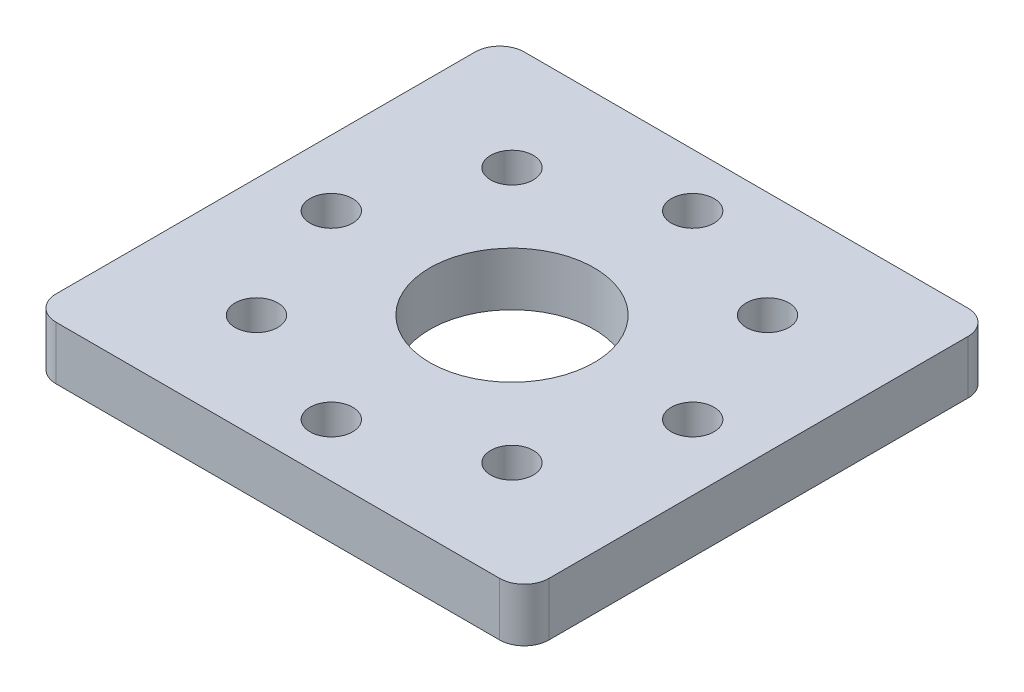
ISO-10303-21;
HEADER;
FILE_DESCRIPTION(('STEP AP214'),'2;1');
FILE_NAME('part.step','',(''),(''),'','','');
FILE_SCHEMA(('AUTOMOTIVE_DESIGN { 1 0 10303 214 1 1 1 1 }'));
ENDSEC;
DATA;
#1=APPLICATION_CONTEXT('core data for automotive mechanical design processes');
#2=APPLICATION_PROTOCOL_DEFINITION('international standard','automotive_design',2000,#1);
#3=PRODUCT_CONTEXT('',#1,'mechanical');
#4=PRODUCT('Part','Part','',(#3));
#5=PRODUCT_RELATED_PRODUCT_CATEGORY('part','',(#4));
#6=PRODUCT_DEFINITION_FORMATION('','',#4);
#7=PRODUCT_DEFINITION_CONTEXT('part definition',#1,'design');
#8=PRODUCT_DEFINITION('design','',#6,#7);
#9=PRODUCT_DEFINITION_SHAPE('','',#8);
#10=(LENGTH_UNIT() NAMED_UNIT(*) SI_UNIT(.MILLI.,.METRE.));
#11=(NAMED_UNIT(*) PLANE_ANGLE_UNIT() SI_UNIT($,.RADIAN.));
#12=(NAMED_UNIT(*) SI_UNIT($,.STERADIAN.) SOLID_ANGLE_UNIT());
#13=UNCERTAINTY_MEASURE_WITH_UNIT(LENGTH_MEASURE(1.E-05),#10,'distance_accuracy_value','');
#14=(GEOMETRIC_REPRESENTATION_CONTEXT(3) GLOBAL_UNCERTAINTY_ASSIGNED_CONTEXT((#13)) GLOBAL_UNIT_ASSIGNED_CONTEXT((#10,
#11,#12)) REPRESENTATION_CONTEXT('',''));
#15=CARTESIAN_POINT('',(0.,0.,0.));
#16=DIRECTION('',(0.,0.,1.));
#17=DIRECTION('',(1.,0.,0.));
#18=AXIS2_PLACEMENT_3D('',#15,#16,#17);
#19=CARTESIAN_POINT('',(-15.,0.1,-14.25));
#20=DIRECTION('',(1.,0.,0.));
#21=DIRECTION('',(0.,0.,-1.));
#22=AXIS2_PLACEMENT_3D('',#19,#20,#21);
#23=PLANE('',#22);
#24=DIRECTION('',(0.,0.,1.));
#25=VECTOR('',#24,1.);
#26=CARTESIAN_POINT('',(-15.,-3.15,-14.25));
#27=LINE('',#26,#25);
#28=CARTESIAN_POINT('',(-15.,-3.15,-12.75));
#29=VERTEX_POINT('',#28);
#30=CARTESIAN_POINT('',(-15.,-3.15,12.75));
#31=VERTEX_POINT('',#30);
#32=EDGE_CURVE('E136',#29,#31,#27,.T.);
#33=ORIENTED_EDGE('',*,*,#32,.T.);
#34=DIRECTION('',(0.,-1.,0.));
#35=VECTOR('',#34,1.);
#36=CARTESIAN_POINT('',(-15.,0.1,12.75));
#37=LINE('',#36,#35);
#38=CARTESIAN_POINT('',(-15.,0.1,12.75));
#39=VERTEX_POINT('',#38);
#40=EDGE_CURVE('E166',#31,#39,#37,.F.);
#41=ORIENTED_EDGE('',*,*,#40,.T.);
#42=DIRECTION('',(0.,0.,1.));
#43=VECTOR('',#42,1.);
#44=CARTESIAN_POINT('',(-15.,0.1,-14.25));
#45=LINE('',#44,#43);
#46=CARTESIAN_POINT('',(-15.,0.1,-12.75));
#47=VERTEX_POINT('',#46);
#48=EDGE_CURVE('E134',#47,#39,#45,.T.);
#49=ORIENTED_EDGE('',*,*,#48,.F.);
#50=DIRECTION('',(0.,-1.,0.));
#51=VECTOR('',#50,1.);
#52=CARTESIAN_POINT('',(-15.,0.1,-12.75));
#53=LINE('',#52,#51);
#54=EDGE_CURVE('E163',#47,#29,#53,.T.);
#55=ORIENTED_EDGE('',*,*,#54,.T.);
#56=EDGE_LOOP('',(#33,#41,#49,#55));
#57=FACE_BOUND('',#56,.T.);
#58=ADVANCED_FACE('F41',(#57),#23,.F.);
#59=CARTESIAN_POINT('',(-15.,0.1,14.25));
#60=DIRECTION('',(0.,0.,-1.));
#61=DIRECTION('',(-1.,0.,0.));
#62=AXIS2_PLACEMENT_3D('',#59,#60,#61);
#63=PLANE('',#62);
#64=DIRECTION('',(1.,0.,0.));
#65=VECTOR('',#64,1.);
#66=CARTESIAN_POINT('',(-15.,-3.15,14.25));
#67=LINE('',#66,#65);
#68=CARTESIAN_POINT('',(-13.5,-3.15,14.25));
#69=VERTEX_POINT('',#68);
#70=CARTESIAN_POINT('',(13.5,-3.15,14.25));
#71=VERTEX_POINT('',#70);
#72=EDGE_CURVE('E132',#69,#71,#67,.T.);
#73=ORIENTED_EDGE('',*,*,#72,.T.);
#74=DIRECTION('',(0.,-1.,0.));
#75=VECTOR('',#74,1.);
#76=CARTESIAN_POINT('',(13.5,0.1,14.25));
#77=LINE('',#76,#75);
#78=CARTESIAN_POINT('',(13.5,0.1,14.25));
#79=VERTEX_POINT('',#78);
#80=EDGE_CURVE('E111',#71,#79,#77,.F.);
#81=ORIENTED_EDGE('',*,*,#80,.T.);
#82=DIRECTION('',(1.,0.,0.));
#83=VECTOR('',#82,1.);
#84=CARTESIAN_POINT('',(-15.,0.1,14.25));
#85=LINE('',#84,#83);
#86=CARTESIAN_POINT('',(-13.5,0.1,14.25));
#87=VERTEX_POINT('',#86);
#88=EDGE_CURVE('E142',#87,#79,#85,.T.);
#89=ORIENTED_EDGE('',*,*,#88,.F.);
#90=DIRECTION('',(0.,-1.,0.));
#91=VECTOR('',#90,1.);
#92=CARTESIAN_POINT('',(-13.5,0.1,14.25));
#93=LINE('',#92,#91);
#94=EDGE_CURVE('E116',#87,#69,#93,.T.);
#95=ORIENTED_EDGE('',*,*,#94,.T.);
#96=EDGE_LOOP('',(#73,#81,#89,#95));
#97=FACE_BOUND('',#96,.T.);
#98=ADVANCED_FACE('F187',(#97),#63,.F.);
#99=CARTESIAN_POINT('',(15.,0.1,-14.25));
#100=DIRECTION('',(-1.,0.,0.));
#101=DIRECTION('',(0.,0.,1.));
#102=AXIS2_PLACEMENT_3D('',#99,#100,#101);
#103=PLANE('',#102);
#104=DIRECTION('',(0.,0.,-1.));
#105=VECTOR('',#104,1.);
#106=CARTESIAN_POINT('',(15.,0.1,-14.25));
#107=LINE('',#106,#105);
#108=CARTESIAN_POINT('',(15.,0.1,12.75));
#109=VERTEX_POINT('',#108);
#110=CARTESIAN_POINT('',(15.,0.1,-12.75));
#111=VERTEX_POINT('',#110);
#112=EDGE_CURVE('E125',#109,#111,#107,.T.);
#113=ORIENTED_EDGE('',*,*,#112,.F.);
#114=DIRECTION('',(0.,-1.,0.));
#115=VECTOR('',#114,1.);
#116=CARTESIAN_POINT('',(15.,0.1,12.75));
#117=LINE('',#116,#115);
#118=CARTESIAN_POINT('',(15.,-3.15,12.75));
#119=VERTEX_POINT('',#118);
#120=EDGE_CURVE('E110',#109,#119,#117,.T.);
#121=ORIENTED_EDGE('',*,*,#120,.T.);
#122=DIRECTION('',(0.,0.,-1.));
#123=VECTOR('',#122,1.);
#124=CARTESIAN_POINT('',(15.,-3.15,-14.25));
#125=LINE('',#124,#123);
#126=CARTESIAN_POINT('',(15.,-3.15,-12.75));
#127=VERTEX_POINT('',#126);
#128=EDGE_CURVE('E123',#119,#127,#125,.T.);
#129=ORIENTED_EDGE('',*,*,#128,.T.);
#130=DIRECTION('',(0.,-1.,0.));
#131=VECTOR('',#130,1.);
#132=CARTESIAN_POINT('',(15.,0.1,-12.75));
#133=LINE('',#132,#131);
#134=EDGE_CURVE('E127',#127,#111,#133,.F.);
#135=ORIENTED_EDGE('',*,*,#134,.T.);
#136=EDGE_LOOP('',(#113,#121,#129,#135));
#137=FACE_BOUND('',#136,.T.);
#138=ADVANCED_FACE('F122',(#137),#103,.F.);
#139=CARTESIAN_POINT('',(-15.,0.1,-14.25));
#140=DIRECTION('',(0.,0.,1.));
#141=DIRECTION('',(1.,0.,0.));
#142=AXIS2_PLACEMENT_3D('',#139,#140,#141);
#143=PLANE('',#142);
#144=DIRECTION('',(-1.,0.,0.));
#145=VECTOR('',#144,1.);
#146=CARTESIAN_POINT('',(-15.,-3.15,-14.25));
#147=LINE('',#146,#145);
#148=CARTESIAN_POINT('',(13.5,-3.15,-14.25));
#149=VERTEX_POINT('',#148);
#150=CARTESIAN_POINT('',(-13.5,-3.15,-14.25));
#151=VERTEX_POINT('',#150);
#152=EDGE_CURVE('E131',#149,#151,#147,.T.);
#153=ORIENTED_EDGE('',*,*,#152,.T.);
#154=DIRECTION('',(0.,-1.,0.));
#155=VECTOR('',#154,1.);
#156=CARTESIAN_POINT('',(-13.5,0.1,-14.25));
#157=LINE('',#156,#155);
#158=CARTESIAN_POINT('',(-13.5,0.1,-14.25));
#159=VERTEX_POINT('',#158);
#160=EDGE_CURVE('E11',#151,#159,#157,.F.);
#161=ORIENTED_EDGE('',*,*,#160,.T.);
#162=DIRECTION('',(-1.,0.,0.));
#163=VECTOR('',#162,1.);
#164=CARTESIAN_POINT('',(-15.,0.1,-14.25));
#165=LINE('',#164,#163);
#166=CARTESIAN_POINT('',(13.5,0.1,-14.25));
#167=VERTEX_POINT('',#166);
#168=EDGE_CURVE('E146',#167,#159,#165,.T.);
#169=ORIENTED_EDGE('',*,*,#168,.F.);
#170=DIRECTION('',(0.,-1.,0.));
#171=VECTOR('',#170,1.);
#172=CARTESIAN_POINT('',(13.5,0.1,-14.25));
#173=LINE('',#172,#171);
#174=EDGE_CURVE('E49',#167,#149,#173,.T.);
#175=ORIENTED_EDGE('',*,*,#174,.T.);
#176=EDGE_LOOP('',(#153,#161,#169,#175));
#177=FACE_BOUND('',#176,.T.);
#178=ADVANCED_FACE('F169',(#177),#143,.F.);
#179=CARTESIAN_POINT('',(0.,0.1,0.));
#180=DIRECTION('',(0.,1.,0.));
#181=DIRECTION('',(0.,0.,1.));
#182=AXIS2_PLACEMENT_3D('',#179,#180,#181);
#183=PLANE('',#182);
#184=CARTESIAN_POINT('',(0.,0.1,-11.));
#185=DIRECTION('',(0.,1.,0.));
#186=DIRECTION('',(0.,0.,1.));
#187=AXIS2_PLACEMENT_3D('',#184,#185,#186);
#188=CIRCLE('',#187,1.3);
#189=CARTESIAN_POINT('',(0.,0.1,-9.7));
#190=VERTEX_POINT('',#189);
#191=EDGE_CURVE('E446',#190,#190,#188,.T.);
#192=ORIENTED_EDGE('',*,*,#191,.F.);
#193=EDGE_LOOP('',(#192));
#194=FACE_BOUND('',#193,.T.);
#195=CARTESIAN_POINT('',(7.77817459305216,0.1,-7.77817459305235));
#196=DIRECTION('',(0.,1.,0.));
#197=DIRECTION('',(0.,0.,1.));
#198=AXIS2_PLACEMENT_3D('',#195,#196,#197);
#199=CIRCLE('',#198,1.30000000000005);
#200=CARTESIAN_POINT('',(7.77817459305216,0.1,-6.4781745930523));
#201=VERTEX_POINT('',#200);
#202=EDGE_CURVE('E452',#201,#201,#199,.T.);
#203=ORIENTED_EDGE('',*,*,#202,.F.);
#204=EDGE_LOOP('',(#203));
#205=FACE_BOUND('',#204,.T.);
#206=CARTESIAN_POINT('',(11.0000000000005,0.1,-4.66937538383073E-13));
#207=DIRECTION('',(0.,1.,0.));
#208=DIRECTION('',(0.,0.,1.));
#209=AXIS2_PLACEMENT_3D('',#206,#207,#208);
#210=CIRCLE('',#209,1.30000000000035);
#211=CARTESIAN_POINT('',(11.0000000000005,0.1,1.29999999999988));
#212=VERTEX_POINT('',#211);
#213=EDGE_CURVE('E463',#212,#212,#210,.T.);
#214=ORIENTED_EDGE('',*,*,#213,.F.);
#215=EDGE_LOOP('',(#214));
#216=FACE_BOUND('',#215,.T.);
#217=CARTESIAN_POINT('',(7.77817459305282,0.1,7.77817459305169));
#218=DIRECTION('',(0.,1.,0.));
#219=DIRECTION('',(0.,0.,1.));
#220=AXIS2_PLACEMENT_3D('',#217,#218,#219);
#221=CIRCLE('',#220,1.30000000000072);
#222=CARTESIAN_POINT('',(7.77817459305282,0.1,9.07817459305241));
#223=VERTEX_POINT('',#222);
#224=EDGE_CURVE('E469',#223,#223,#221,.T.);
#225=ORIENTED_EDGE('',*,*,#224,.F.);
#226=EDGE_LOOP('',(#225));
#227=FACE_BOUND('',#226,.T.);
#228=CARTESIAN_POINT('',(9.33875076766146E-13,0.1,11.));
#229=DIRECTION('',(0.,1.,0.));
#230=DIRECTION('',(0.,0.,1.));
#231=AXIS2_PLACEMENT_3D('',#228,#229,#230);
#232=CIRCLE('',#231,1.30000000000097);
#233=CARTESIAN_POINT('',(9.33875076766146E-13,0.1,12.300000000001));
#234=VERTEX_POINT('',#233);
#235=EDGE_CURVE('E475',#234,#234,#232,.T.);
#236=ORIENTED_EDGE('',*,*,#235,.F.);
#237=EDGE_LOOP('',(#236));
#238=FACE_BOUND('',#237,.T.);
#239=CARTESIAN_POINT('',(-7.77817459305122,0.1,7.77817459305235));
#240=DIRECTION('',(0.,1.,0.));
#241=DIRECTION('',(0.,0.,1.));
#242=AXIS2_PLACEMENT_3D('',#239,#240,#241);
#243=CIRCLE('',#242,1.30000000000095);
#244=CARTESIAN_POINT('',(-7.77817459305122,0.1,9.0781745930533));
#245=VERTEX_POINT('',#244);
#246=EDGE_CURVE('E490',#245,#245,#243,.T.);
#247=ORIENTED_EDGE('',*,*,#246,.F.);
#248=EDGE_LOOP('',(#247));
#249=FACE_BOUND('',#248,.T.);
#250=CARTESIAN_POINT('',(-10.9999999999995,0.1,4.68284649862135E-13));
#251=DIRECTION('',(0.,1.,0.));
#252=DIRECTION('',(0.,0.,1.));
#253=AXIS2_PLACEMENT_3D('',#250,#251,#252);
#254=CIRCLE('',#253,1.30000000000069);
#255=CARTESIAN_POINT('',(-10.9999999999995,0.1,1.30000000000116));
#256=VERTEX_POINT('',#255);
#257=EDGE_CURVE('E498',#256,#256,#254,.T.);
#258=ORIENTED_EDGE('',*,*,#257,.F.);
#259=EDGE_LOOP('',(#258));
#260=FACE_BOUND('',#259,.T.);
#261=CARTESIAN_POINT('',(-7.77817459305189,0.1,-7.77817459305169));
#262=DIRECTION('',(0.,1.,0.));
#263=DIRECTION('',(0.,0.,1.));
#264=AXIS2_PLACEMENT_3D('',#261,#262,#263);
#265=CIRCLE('',#264,1.30000000000036);
#266=CARTESIAN_POINT('',(-7.77817459305189,0.1,-6.47817459305133));
#267=VERTEX_POINT('',#266);
#268=EDGE_CURVE('E503',#267,#267,#265,.T.);
#269=ORIENTED_EDGE('',*,*,#268,.F.);
#270=EDGE_LOOP('',(#269));
#271=FACE_BOUND('',#270,.T.);
#272=CARTESIAN_POINT('',(0.,0.1,0.));
#273=DIRECTION('',(0.,1.,0.));
#274=DIRECTION('',(0.,0.,1.));
#275=AXIS2_PLACEMENT_3D('',#272,#273,#274);
#276=CIRCLE('',#275,5.);
#277=CARTESIAN_POINT('',(0.,0.1,5.));
#278=VERTEX_POINT('',#277);
#279=EDGE_CURVE('E447',#278,#278,#276,.T.);
#280=ORIENTED_EDGE('',*,*,#279,.F.);
#281=EDGE_LOOP('',(#280));
#282=FACE_BOUND('',#281,.T.);
#283=ORIENTED_EDGE('',*,*,#88,.T.);
#284=CARTESIAN_POINT('',(13.5,0.1,12.75));
#285=DIRECTION('',(0.,1.,0.));
#286=DIRECTION('',(0.,0.,1.));
#287=AXIS2_PLACEMENT_3D('',#284,#285,#286);
#288=CIRCLE('',#287,1.5);
#289=EDGE_CURVE('E161',#79,#109,#288,.T.);
#290=ORIENTED_EDGE('',*,*,#289,.T.);
#291=ORIENTED_EDGE('',*,*,#112,.T.);
#292=CARTESIAN_POINT('',(13.5,0.1,-12.75));
#293=DIRECTION('',(0.,1.,0.));
#294=DIRECTION('',(0.,0.,1.));
#295=AXIS2_PLACEMENT_3D('',#292,#293,#294);
#296=CIRCLE('',#295,1.5);
#297=EDGE_CURVE('E61',#111,#167,#296,.T.);
#298=ORIENTED_EDGE('',*,*,#297,.T.);
#299=ORIENTED_EDGE('',*,*,#168,.T.);
#300=CARTESIAN_POINT('',(-13.5,0.1,-12.75));
#301=DIRECTION('',(0.,1.,0.));
#302=DIRECTION('',(0.,0.,1.));
#303=AXIS2_PLACEMENT_3D('',#300,#301,#302);
#304=CIRCLE('',#303,1.5);
#305=EDGE_CURVE('E157',#159,#47,#304,.T.);
#306=ORIENTED_EDGE('',*,*,#305,.T.);
#307=ORIENTED_EDGE('',*,*,#48,.T.);
#308=CARTESIAN_POINT('',(-13.5,0.1,12.75));
#309=DIRECTION('',(0.,1.,0.));
#310=DIRECTION('',(0.,0.,1.));
#311=AXIS2_PLACEMENT_3D('',#308,#309,#310);
#312=CIRCLE('',#311,1.5);
#313=EDGE_CURVE('E159',#39,#87,#312,.T.);
#314=ORIENTED_EDGE('',*,*,#313,.T.);
#315=EDGE_LOOP('',(#283,#290,#291,#298,#299,#306,#307,#314));
#316=FACE_BOUND('',#315,.T.);
#317=ADVANCED_FACE('F181',(#194,#205,#216,#227,#238,#249,#260,#271,#282,#316),#183,.T.);
#318=CARTESIAN_POINT('',(0.,-3.15,0.));
#319=DIRECTION('',(0.,1.,0.));
#320=DIRECTION('',(0.,0.,1.));
#321=AXIS2_PLACEMENT_3D('',#318,#319,#320);
#322=PLANE('',#321);
#323=CARTESIAN_POINT('',(0.,-3.15,-11.));
#324=DIRECTION('',(0.,1.,0.));
#325=DIRECTION('',(0.,0.,1.));
#326=AXIS2_PLACEMENT_3D('',#323,#324,#325);
#327=CIRCLE('',#326,1.3);
#328=CARTESIAN_POINT('',(0.,-3.15,-9.7));
#329=VERTEX_POINT('',#328);
#330=EDGE_CURVE('E443',#329,#329,#327,.T.);
#331=ORIENTED_EDGE('',*,*,#330,.T.);
#332=EDGE_LOOP('',(#331));
#333=FACE_BOUND('',#332,.T.);
#334=CARTESIAN_POINT('',(7.77817459305216,-3.15,-7.77817459305235));
#335=DIRECTION('',(0.,1.,0.));
#336=DIRECTION('',(0.,0.,1.));
#337=AXIS2_PLACEMENT_3D('',#334,#335,#336);
#338=CIRCLE('',#337,1.30000000000005);
#339=CARTESIAN_POINT('',(7.77817459305216,-3.15,-6.4781745930523));
#340=VERTEX_POINT('',#339);
#341=EDGE_CURVE('E460',#340,#340,#338,.T.);
#342=ORIENTED_EDGE('',*,*,#341,.T.);
#343=EDGE_LOOP('',(#342));
#344=FACE_BOUND('',#343,.T.);
#345=CARTESIAN_POINT('',(11.0000000000005,-3.15,-4.66937538383073E-13));
#346=DIRECTION('',(0.,1.,0.));
#347=DIRECTION('',(0.,0.,1.));
#348=AXIS2_PLACEMENT_3D('',#345,#346,#347);
#349=CIRCLE('',#348,1.30000000000035);
#350=CARTESIAN_POINT('',(11.0000000000005,-3.15,1.29999999999988));
#351=VERTEX_POINT('',#350);
#352=EDGE_CURVE('E466',#351,#351,#349,.T.);
#353=ORIENTED_EDGE('',*,*,#352,.T.);
#354=EDGE_LOOP('',(#353));
#355=FACE_BOUND('',#354,.T.);
#356=CARTESIAN_POINT('',(7.77817459305282,-3.15,7.77817459305169));
#357=DIRECTION('',(0.,1.,0.));
#358=DIRECTION('',(0.,0.,1.));
#359=AXIS2_PLACEMENT_3D('',#356,#357,#358);
#360=CIRCLE('',#359,1.30000000000072);
#361=CARTESIAN_POINT('',(7.77817459305282,-3.15,9.07817459305241));
#362=VERTEX_POINT('',#361);
#363=EDGE_CURVE('E472',#362,#362,#360,.T.);
#364=ORIENTED_EDGE('',*,*,#363,.T.);
#365=EDGE_LOOP('',(#364));
#366=FACE_BOUND('',#365,.T.);
#367=CARTESIAN_POINT('',(9.33875076766146E-13,-3.15,11.));
#368=DIRECTION('',(0.,1.,0.));
#369=DIRECTION('',(0.,0.,1.));
#370=AXIS2_PLACEMENT_3D('',#367,#368,#369);
#371=CIRCLE('',#370,1.30000000000097);
#372=CARTESIAN_POINT('',(9.33875076766146E-13,-3.15,12.300000000001));
#373=VERTEX_POINT('',#372);
#374=EDGE_CURVE('E485',#373,#373,#371,.T.);
#375=ORIENTED_EDGE('',*,*,#374,.T.);
#376=EDGE_LOOP('',(#375));
#377=FACE_BOUND('',#376,.T.);
#378=CARTESIAN_POINT('',(-7.77817459305122,-3.15,7.77817459305235));
#379=DIRECTION('',(0.,1.,0.));
#380=DIRECTION('',(0.,0.,1.));
#381=AXIS2_PLACEMENT_3D('',#378,#379,#380);
#382=CIRCLE('',#381,1.30000000000095);
#383=CARTESIAN_POINT('',(-7.77817459305122,-3.15,9.0781745930533));
#384=VERTEX_POINT('',#383);
#385=EDGE_CURVE('E495',#384,#384,#382,.T.);
#386=ORIENTED_EDGE('',*,*,#385,.T.);
#387=EDGE_LOOP('',(#386));
#388=FACE_BOUND('',#387,.T.);
#389=CARTESIAN_POINT('',(-10.9999999999995,-3.15,4.68284649862135E-13));
#390=DIRECTION('',(0.,1.,0.));
#391=DIRECTION('',(0.,0.,1.));
#392=AXIS2_PLACEMENT_3D('',#389,#390,#391);
#393=CIRCLE('',#392,1.30000000000069);
#394=CARTESIAN_POINT('',(-10.9999999999995,-3.15,1.30000000000116));
#395=VERTEX_POINT('',#394);
#396=EDGE_CURVE('E501',#395,#395,#393,.T.);
#397=ORIENTED_EDGE('',*,*,#396,.T.);
#398=EDGE_LOOP('',(#397));
#399=FACE_BOUND('',#398,.T.);
#400=CARTESIAN_POINT('',(-7.77817459305189,-3.15,-7.77817459305169));
#401=DIRECTION('',(0.,1.,0.));
#402=DIRECTION('',(0.,0.,1.));
#403=AXIS2_PLACEMENT_3D('',#400,#401,#402);
#404=CIRCLE('',#403,1.30000000000036);
#405=CARTESIAN_POINT('',(-7.77817459305189,-3.15,-6.47817459305133));
#406=VERTEX_POINT('',#405);
#407=EDGE_CURVE('E455',#406,#406,#404,.T.);
#408=ORIENTED_EDGE('',*,*,#407,.T.);
#409=EDGE_LOOP('',(#408));
#410=FACE_BOUND('',#409,.T.);
#411=CARTESIAN_POINT('',(0.,-3.15,0.));
#412=DIRECTION('',(0.,1.,0.));
#413=DIRECTION('',(0.,0.,1.));
#414=AXIS2_PLACEMENT_3D('',#411,#412,#413);
#415=CIRCLE('',#414,5.);
#416=CARTESIAN_POINT('',(0.,-3.15,5.));
#417=VERTEX_POINT('',#416);
#418=EDGE_CURVE('E450',#417,#417,#415,.T.);
#419=ORIENTED_EDGE('',*,*,#418,.T.);
#420=EDGE_LOOP('',(#419));
#421=FACE_BOUND('',#420,.T.);
#422=ORIENTED_EDGE('',*,*,#128,.F.);
#423=CARTESIAN_POINT('',(13.5,-3.15,12.75));
#424=DIRECTION('',(0.,1.,0.));
#425=DIRECTION('',(0.,0.,1.));
#426=AXIS2_PLACEMENT_3D('',#423,#424,#425);
#427=CIRCLE('',#426,1.5);
#428=EDGE_CURVE('E106',#119,#71,#427,.F.);
#429=ORIENTED_EDGE('',*,*,#428,.T.);
#430=ORIENTED_EDGE('',*,*,#72,.F.);
#431=CARTESIAN_POINT('',(-13.5,-3.15,12.75));
#432=DIRECTION('',(0.,1.,0.));
#433=DIRECTION('',(0.,0.,1.));
#434=AXIS2_PLACEMENT_3D('',#431,#432,#433);
#435=CIRCLE('',#434,1.5);
#436=EDGE_CURVE('E117',#69,#31,#435,.F.);
#437=ORIENTED_EDGE('',*,*,#436,.T.);
#438=ORIENTED_EDGE('',*,*,#32,.F.);
#439=CARTESIAN_POINT('',(-13.5,-3.15,-12.75));
#440=DIRECTION('',(0.,1.,0.));
#441=DIRECTION('',(0.,0.,1.));
#442=AXIS2_PLACEMENT_3D('',#439,#440,#441);
#443=CIRCLE('',#442,1.5);
#444=EDGE_CURVE('E150',#29,#151,#443,.F.);
#445=ORIENTED_EDGE('',*,*,#444,.T.);
#446=ORIENTED_EDGE('',*,*,#152,.F.);
#447=CARTESIAN_POINT('',(13.5,-3.15,-12.75));
#448=DIRECTION('',(0.,1.,0.));
#449=DIRECTION('',(0.,0.,1.));
#450=AXIS2_PLACEMENT_3D('',#447,#448,#449);
#451=CIRCLE('',#450,1.5);
#452=EDGE_CURVE('E126',#149,#127,#451,.F.);
#453=ORIENTED_EDGE('',*,*,#452,.T.);
#454=EDGE_LOOP('',(#422,#429,#430,#437,#438,#445,#446,#453));
#455=FACE_BOUND('',#454,.T.);
#456=ADVANCED_FACE('F129',(#333,#344,#355,#366,#377,#388,#399,#410,#421,#455),#322,.F.);
#457=CARTESIAN_POINT('',(0.,-3.15,0.));
#458=DIRECTION('',(0.,1.,0.));
#459=DIRECTION('',(0.,0.,1.));
#460=AXIS2_PLACEMENT_3D('',#457,#458,#459);
#461=CYLINDRICAL_SURFACE('',#460,5.);
#462=ORIENTED_EDGE('',*,*,#418,.F.);
#463=EDGE_LOOP('',(#462));
#464=FACE_BOUND('',#463,.T.);
#465=ORIENTED_EDGE('',*,*,#279,.T.);
#466=EDGE_LOOP('',(#465));
#467=FACE_BOUND('',#466,.T.);
#468=ADVANCED_FACE('F253',(#464,#467),#461,.F.);
#469=CARTESIAN_POINT('',(-7.77817459305189,-3.15,-7.77817459305169));
#470=DIRECTION('',(0.,1.,0.));
#471=DIRECTION('',(0.,0.,1.));
#472=AXIS2_PLACEMENT_3D('',#469,#470,#471);
#473=CYLINDRICAL_SURFACE('',#472,1.30000000000036);
#474=ORIENTED_EDGE('',*,*,#407,.F.);
#475=EDGE_LOOP('',(#474));
#476=FACE_BOUND('',#475,.T.);
#477=ORIENTED_EDGE('',*,*,#268,.T.);
#478=EDGE_LOOP('',(#477));
#479=FACE_BOUND('',#478,.T.);
#480=ADVANCED_FACE('F263',(#476,#479),#473,.F.);
#481=CARTESIAN_POINT('',(-10.9999999999995,-3.15,4.68284649862135E-13));
#482=DIRECTION('',(0.,1.,0.));
#483=DIRECTION('',(0.,0.,1.));
#484=AXIS2_PLACEMENT_3D('',#481,#482,#483);
#485=CYLINDRICAL_SURFACE('',#484,1.30000000000069);
#486=ORIENTED_EDGE('',*,*,#396,.F.);
#487=EDGE_LOOP('',(#486));
#488=FACE_BOUND('',#487,.T.);
#489=ORIENTED_EDGE('',*,*,#257,.T.);
#490=EDGE_LOOP('',(#489));
#491=FACE_BOUND('',#490,.T.);
#492=ADVANCED_FACE('F272',(#488,#491),#485,.F.);
#493=CARTESIAN_POINT('',(-7.77817459305122,-3.15,7.77817459305235));
#494=DIRECTION('',(0.,1.,0.));
#495=DIRECTION('',(0.,0.,1.));
#496=AXIS2_PLACEMENT_3D('',#493,#494,#495);
#497=CYLINDRICAL_SURFACE('',#496,1.30000000000095);
#498=ORIENTED_EDGE('',*,*,#385,.F.);
#499=EDGE_LOOP('',(#498));
#500=FACE_BOUND('',#499,.T.);
#501=ORIENTED_EDGE('',*,*,#246,.T.);
#502=EDGE_LOOP('',(#501));
#503=FACE_BOUND('',#502,.T.);
#504=ADVANCED_FACE('F281',(#500,#503),#497,.F.);
#505=CARTESIAN_POINT('',(9.33875076766146E-13,-3.15,11.));
#506=DIRECTION('',(0.,1.,0.));
#507=DIRECTION('',(0.,0.,1.));
#508=AXIS2_PLACEMENT_3D('',#505,#506,#507);
#509=CYLINDRICAL_SURFACE('',#508,1.30000000000097);
#510=ORIENTED_EDGE('',*,*,#374,.F.);
#511=EDGE_LOOP('',(#510));
#512=FACE_BOUND('',#511,.T.);
#513=ORIENTED_EDGE('',*,*,#235,.T.);
#514=EDGE_LOOP('',(#513));
#515=FACE_BOUND('',#514,.T.);
#516=ADVANCED_FACE('F289',(#512,#515),#509,.F.);
#517=CARTESIAN_POINT('',(7.77817459305282,-3.15,7.77817459305169));
#518=DIRECTION('',(0.,1.,0.));
#519=DIRECTION('',(0.,0.,1.));
#520=AXIS2_PLACEMENT_3D('',#517,#518,#519);
#521=CYLINDRICAL_SURFACE('',#520,1.30000000000072);
#522=ORIENTED_EDGE('',*,*,#363,.F.);
#523=EDGE_LOOP('',(#522));
#524=FACE_BOUND('',#523,.T.);
#525=ORIENTED_EDGE('',*,*,#224,.T.);
#526=EDGE_LOOP('',(#525));
#527=FACE_BOUND('',#526,.T.);
#528=ADVANCED_FACE('F298',(#524,#527),#521,.F.);
#529=CARTESIAN_POINT('',(11.0000000000005,-3.15,-4.66937538383073E-13));
#530=DIRECTION('',(0.,1.,0.));
#531=DIRECTION('',(0.,0.,1.));
#532=AXIS2_PLACEMENT_3D('',#529,#530,#531);
#533=CYLINDRICAL_SURFACE('',#532,1.30000000000035);
#534=ORIENTED_EDGE('',*,*,#352,.F.);
#535=EDGE_LOOP('',(#534));
#536=FACE_BOUND('',#535,.T.);
#537=ORIENTED_EDGE('',*,*,#213,.T.);
#538=EDGE_LOOP('',(#537));
#539=FACE_BOUND('',#538,.T.);
#540=ADVANCED_FACE('F306',(#536,#539),#533,.F.);
#541=CARTESIAN_POINT('',(7.77817459305216,-3.15,-7.77817459305235));
#542=DIRECTION('',(0.,1.,0.));
#543=DIRECTION('',(0.,0.,1.));
#544=AXIS2_PLACEMENT_3D('',#541,#542,#543);
#545=CYLINDRICAL_SURFACE('',#544,1.30000000000005);
#546=ORIENTED_EDGE('',*,*,#341,.F.);
#547=EDGE_LOOP('',(#546));
#548=FACE_BOUND('',#547,.T.);
#549=ORIENTED_EDGE('',*,*,#202,.T.);
#550=EDGE_LOOP('',(#549));
#551=FACE_BOUND('',#550,.T.);
#552=ADVANCED_FACE('F313',(#548,#551),#545,.F.);
#553=CARTESIAN_POINT('',(0.,-3.15,-11.));
#554=DIRECTION('',(0.,1.,0.));
#555=DIRECTION('',(0.,0.,1.));
#556=AXIS2_PLACEMENT_3D('',#553,#554,#555);
#557=CYLINDRICAL_SURFACE('',#556,1.3);
#558=ORIENTED_EDGE('',*,*,#330,.F.);
#559=EDGE_LOOP('',(#558));
#560=FACE_BOUND('',#559,.T.);
#561=ORIENTED_EDGE('',*,*,#191,.T.);
#562=EDGE_LOOP('',(#561));
#563=FACE_BOUND('',#562,.T.);
#564=ADVANCED_FACE('F202',(#560,#563),#557,.F.);
#565=CARTESIAN_POINT('',(13.5,0.1,12.75));
#566=DIRECTION('',(0.,-1.,0.));
#567=DIRECTION('',(0.,0.,-1.));
#568=AXIS2_PLACEMENT_3D('',#565,#566,#567);
#569=CYLINDRICAL_SURFACE('',#568,1.5);
#570=ORIENTED_EDGE('',*,*,#289,.F.);
#571=ORIENTED_EDGE('',*,*,#80,.F.);
#572=ORIENTED_EDGE('',*,*,#428,.F.);
#573=ORIENTED_EDGE('',*,*,#120,.F.);
#574=EDGE_LOOP('',(#570,#571,#572,#573));
#575=FACE_BOUND('',#574,.T.);
#576=ADVANCED_FACE('F109',(#575),#569,.T.);
#577=CARTESIAN_POINT('',(-13.5,0.1,12.75));
#578=DIRECTION('',(0.,-1.,0.));
#579=DIRECTION('',(0.,0.,-1.));
#580=AXIS2_PLACEMENT_3D('',#577,#578,#579);
#581=CYLINDRICAL_SURFACE('',#580,1.5);
#582=ORIENTED_EDGE('',*,*,#313,.F.);
#583=ORIENTED_EDGE('',*,*,#40,.F.);
#584=ORIENTED_EDGE('',*,*,#436,.F.);
#585=ORIENTED_EDGE('',*,*,#94,.F.);
#586=EDGE_LOOP('',(#582,#583,#584,#585));
#587=FACE_BOUND('',#586,.T.);
#588=ADVANCED_FACE('F185',(#587),#581,.T.);
#589=CARTESIAN_POINT('',(-13.5,0.1,-12.75));
#590=DIRECTION('',(0.,-1.,0.));
#591=DIRECTION('',(0.,0.,-1.));
#592=AXIS2_PLACEMENT_3D('',#589,#590,#591);
#593=CYLINDRICAL_SURFACE('',#592,1.5);
#594=ORIENTED_EDGE('',*,*,#305,.F.);
#595=ORIENTED_EDGE('',*,*,#160,.F.);
#596=ORIENTED_EDGE('',*,*,#444,.F.);
#597=ORIENTED_EDGE('',*,*,#54,.F.);
#598=EDGE_LOOP('',(#594,#595,#596,#597));
#599=FACE_BOUND('',#598,.T.);
#600=ADVANCED_FACE('F176',(#599),#593,.T.);
#601=CARTESIAN_POINT('',(13.5,0.1,-12.75));
#602=DIRECTION('',(0.,-1.,0.));
#603=DIRECTION('',(0.,0.,-1.));
#604=AXIS2_PLACEMENT_3D('',#601,#602,#603);
#605=CYLINDRICAL_SURFACE('',#604,1.5);
#606=ORIENTED_EDGE('',*,*,#297,.F.);
#607=ORIENTED_EDGE('',*,*,#134,.F.);
#608=ORIENTED_EDGE('',*,*,#452,.F.);
#609=ORIENTED_EDGE('',*,*,#174,.F.);
#610=EDGE_LOOP('',(#606,#607,#608,#609));
#611=FACE_BOUND('',#610,.T.);
#612=ADVANCED_FACE('F43',(#611),#605,.T.);
#613=CLOSED_SHELL('',(#58,#98,#138,#178,#317,#456,#468,#480,#492,#504,#516,#528,#540,#552,#564,
#576,#588,#600,#612));
#614=MANIFOLD_SOLID_BREP('B2',#613);
#615=ADVANCED_BREP_SHAPE_REPRESENTATION('',(#18,#614),#14);
#616=SHAPE_DEFINITION_REPRESENTATION(#9,#615);
ENDSEC;
END-ISO-10303-21;
